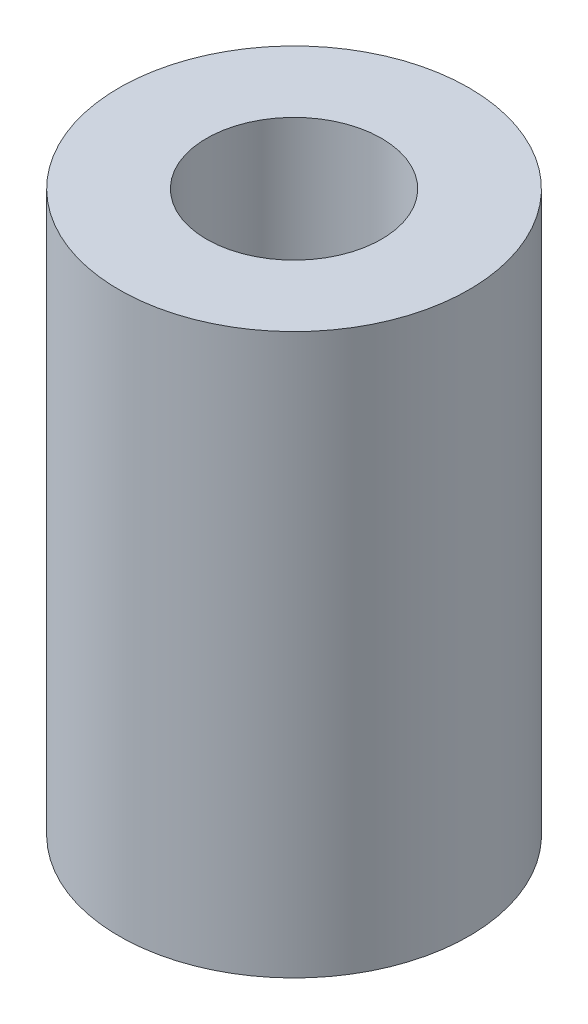
ISO-10303-21;
HEADER;
FILE_DESCRIPTION(('STEP AP214'),'2;1');
FILE_NAME('part.step','',(''),(''),'','','');
FILE_SCHEMA(('AUTOMOTIVE_DESIGN { 1 0 10303 214 1 1 1 1 }'));
ENDSEC;
DATA;
#1=APPLICATION_CONTEXT('core data for automotive mechanical design processes');
#2=APPLICATION_PROTOCOL_DEFINITION('international standard','automotive_design',2000,#1);
#3=PRODUCT_CONTEXT('',#1,'mechanical');
#4=PRODUCT('Part','Part','',(#3));
#5=PRODUCT_RELATED_PRODUCT_CATEGORY('part','',(#4));
#6=PRODUCT_DEFINITION_FORMATION('','',#4);
#7=PRODUCT_DEFINITION_CONTEXT('part definition',#1,'design');
#8=PRODUCT_DEFINITION('design','',#6,#7);
#9=PRODUCT_DEFINITION_SHAPE('','',#8);
#10=(LENGTH_UNIT() NAMED_UNIT(*) SI_UNIT(.MILLI.,.METRE.));
#11=(NAMED_UNIT(*) PLANE_ANGLE_UNIT() SI_UNIT($,.RADIAN.));
#12=(NAMED_UNIT(*) SI_UNIT($,.STERADIAN.) SOLID_ANGLE_UNIT());
#13=UNCERTAINTY_MEASURE_WITH_UNIT(LENGTH_MEASURE(1.E-05),#10,'distance_accuracy_value','');
#14=(GEOMETRIC_REPRESENTATION_CONTEXT(3) GLOBAL_UNCERTAINTY_ASSIGNED_CONTEXT((#13)) GLOBAL_UNIT_ASSIGNED_CONTEXT((#10,
#11,#12)) REPRESENTATION_CONTEXT('',''));
#15=CARTESIAN_POINT('',(0.,0.,0.));
#16=DIRECTION('',(0.,0.,1.));
#17=DIRECTION('',(1.,0.,0.));
#18=AXIS2_PLACEMENT_3D('',#15,#16,#17);
#19=CARTESIAN_POINT('',(0.,0.,0.));
#20=DIRECTION('',(0.,-1.,0.));
#21=DIRECTION('',(0.,0.,-1.));
#22=AXIS2_PLACEMENT_3D('',#19,#20,#21);
#23=CYLINDRICAL_SURFACE('',#22,5.);
#24=CARTESIAN_POINT('',(0.,16.,0.));
#25=DIRECTION('',(0.,-1.,0.));
#26=DIRECTION('',(0.,0.,-1.));
#27=AXIS2_PLACEMENT_3D('',#24,#25,#26);
#28=CIRCLE('',#27,5.);
#29=CARTESIAN_POINT('',(0.,16.,-5.));
#30=VERTEX_POINT('',#29);
#31=EDGE_CURVE('E54',#30,#30,#28,.T.);
#32=ORIENTED_EDGE('',*,*,#31,.T.);
#33=EDGE_LOOP('',(#32));
#34=FACE_BOUND('',#33,.T.);
#35=CARTESIAN_POINT('',(0.,0.,0.));
#36=DIRECTION('',(0.,-1.,0.));
#37=DIRECTION('',(0.,0.,-1.));
#38=AXIS2_PLACEMENT_3D('',#35,#36,#37);
#39=CIRCLE('',#38,5.);
#40=CARTESIAN_POINT('',(0.,0.,-5.));
#41=VERTEX_POINT('',#40);
#42=EDGE_CURVE('E10',#41,#41,#39,.T.);
#43=ORIENTED_EDGE('',*,*,#42,.F.);
#44=EDGE_LOOP('',(#43));
#45=FACE_BOUND('',#44,.T.);
#46=ADVANCED_FACE('F37',(#34,#45),#23,.T.);
#47=CARTESIAN_POINT('',(2.5,0.,0.));
#48=DIRECTION('',(0.,-1.,0.));
#49=DIRECTION('',(0.,0.,-1.));
#50=AXIS2_PLACEMENT_3D('',#47,#48,#49);
#51=PLANE('',#50);
#52=ORIENTED_EDGE('',*,*,#42,.T.);
#53=EDGE_LOOP('',(#52));
#54=FACE_BOUND('',#53,.T.);
#55=CARTESIAN_POINT('',(0.,0.,0.));
#56=DIRECTION('',(0.,-1.,0.));
#57=DIRECTION('',(0.,0.,-1.));
#58=AXIS2_PLACEMENT_3D('',#55,#56,#57);
#59=CIRCLE('',#58,2.5);
#60=CARTESIAN_POINT('',(0.,0.,-2.5));
#61=VERTEX_POINT('',#60);
#62=EDGE_CURVE('E44',#61,#61,#59,.T.);
#63=ORIENTED_EDGE('',*,*,#62,.F.);
#64=EDGE_LOOP('',(#63));
#65=FACE_BOUND('',#64,.T.);
#66=ADVANCED_FACE('F71',(#54,#65),#51,.T.);
#67=CARTESIAN_POINT('',(0.,0.,0.));
#68=DIRECTION('',(0.,-1.,0.));
#69=DIRECTION('',(0.,0.,-1.));
#70=AXIS2_PLACEMENT_3D('',#67,#68,#69);
#71=CYLINDRICAL_SURFACE('',#70,2.5);
#72=ORIENTED_EDGE('',*,*,#62,.T.);
#73=EDGE_LOOP('',(#72));
#74=FACE_BOUND('',#73,.T.);
#75=CARTESIAN_POINT('',(0.,16.,0.));
#76=DIRECTION('',(0.,-1.,0.));
#77=DIRECTION('',(0.,0.,-1.));
#78=AXIS2_PLACEMENT_3D('',#75,#76,#77);
#79=CIRCLE('',#78,2.5);
#80=CARTESIAN_POINT('',(0.,16.,-2.5));
#81=VERTEX_POINT('',#80);
#82=EDGE_CURVE('E49',#81,#81,#79,.T.);
#83=ORIENTED_EDGE('',*,*,#82,.F.);
#84=EDGE_LOOP('',(#83));
#85=FACE_BOUND('',#84,.T.);
#86=ADVANCED_FACE('F65',(#74,#85),#71,.F.);
#87=CARTESIAN_POINT('',(2.5,16.,0.));
#88=DIRECTION('',(0.,1.,0.));
#89=DIRECTION('',(0.,0.,1.));
#90=AXIS2_PLACEMENT_3D('',#87,#88,#89);
#91=PLANE('',#90);
#92=ORIENTED_EDGE('',*,*,#82,.T.);
#93=EDGE_LOOP('',(#92));
#94=FACE_BOUND('',#93,.T.);
#95=ORIENTED_EDGE('',*,*,#31,.F.);
#96=EDGE_LOOP('',(#95));
#97=FACE_BOUND('',#96,.T.);
#98=ADVANCED_FACE('F63',(#94,#97),#91,.T.);
#99=CLOSED_SHELL('',(#46,#66,#86,#98));
#100=MANIFOLD_SOLID_BREP('B2',#99);
#101=ADVANCED_BREP_SHAPE_REPRESENTATION('',(#18,#100),#14);
#102=SHAPE_DEFINITION_REPRESENTATION(#9,#101);
ENDSEC;
END-ISO-10303-21;
